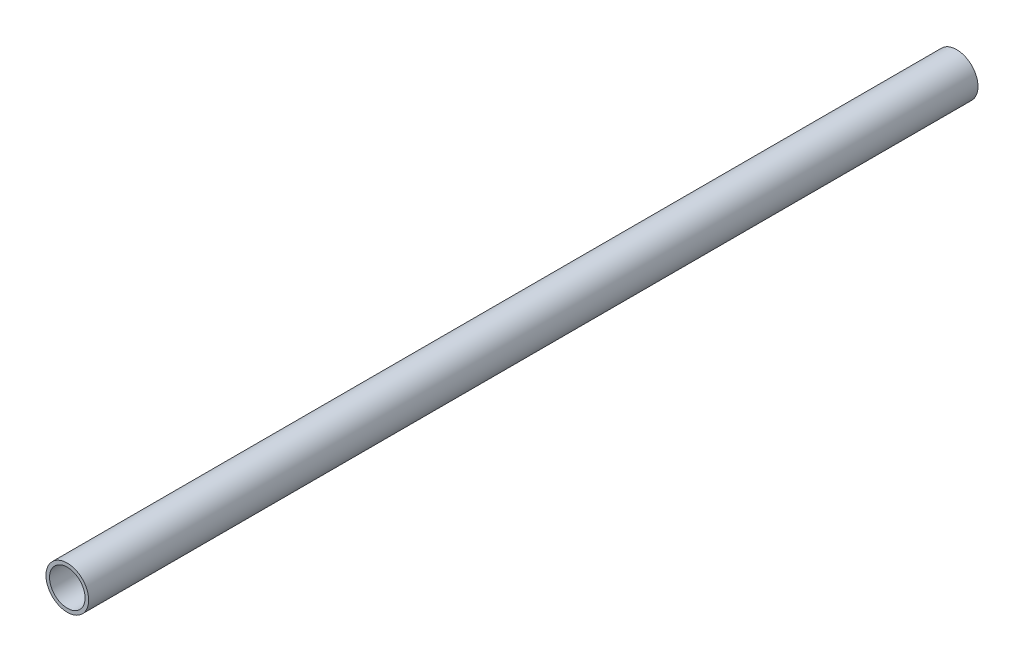
ISO-10303-21;
HEADER;
FILE_DESCRIPTION(('STEP AP214'),'2;1');
FILE_NAME('part.step','',(''),(''),'','','');
FILE_SCHEMA(('AUTOMOTIVE_DESIGN { 1 0 10303 214 1 1 1 1 }'));
ENDSEC;
DATA;
#1=APPLICATION_CONTEXT('core data for automotive mechanical design processes');
#2=APPLICATION_PROTOCOL_DEFINITION('international standard','automotive_design',2000,#1);
#3=PRODUCT_CONTEXT('',#1,'mechanical');
#4=PRODUCT('Part','Part','',(#3));
#5=PRODUCT_RELATED_PRODUCT_CATEGORY('part','',(#4));
#6=PRODUCT_DEFINITION_FORMATION('','',#4);
#7=PRODUCT_DEFINITION_CONTEXT('part definition',#1,'design');
#8=PRODUCT_DEFINITION('design','',#6,#7);
#9=PRODUCT_DEFINITION_SHAPE('','',#8);
#10=(LENGTH_UNIT() NAMED_UNIT(*) SI_UNIT(.MILLI.,.METRE.));
#11=(NAMED_UNIT(*) PLANE_ANGLE_UNIT() SI_UNIT($,.RADIAN.));
#12=(NAMED_UNIT(*) SI_UNIT($,.STERADIAN.) SOLID_ANGLE_UNIT());
#13=UNCERTAINTY_MEASURE_WITH_UNIT(LENGTH_MEASURE(1.E-05),#10,'distance_accuracy_value','');
#14=(GEOMETRIC_REPRESENTATION_CONTEXT(3) GLOBAL_UNCERTAINTY_ASSIGNED_CONTEXT((#13)) GLOBAL_UNIT_ASSIGNED_CONTEXT((#10,
#11,#12)) REPRESENTATION_CONTEXT('',''));
#15=CARTESIAN_POINT('',(0.,0.,0.));
#16=DIRECTION('',(0.,0.,1.));
#17=DIRECTION('',(1.,0.,0.));
#18=AXIS2_PLACEMENT_3D('',#15,#16,#17);
#19=CARTESIAN_POINT('',(0.,0.,250.));
#20=DIRECTION('',(0.,0.,-1.));
#21=DIRECTION('',(-1.,0.,0.));
#22=AXIS2_PLACEMENT_3D('',#19,#20,#21);
#23=CYLINDRICAL_SURFACE('',#22,6.);
#24=CARTESIAN_POINT('',(0.,0.,250.));
#25=DIRECTION('',(0.,0.,1.));
#26=DIRECTION('',(1.,0.,0.));
#27=AXIS2_PLACEMENT_3D('',#24,#25,#26);
#28=CIRCLE('',#27,6.);
#29=CARTESIAN_POINT('',(6.,0.,250.));
#30=VERTEX_POINT('',#29);
#31=EDGE_CURVE('E10',#30,#30,#28,.T.);
#32=ORIENTED_EDGE('',*,*,#31,.F.);
#33=EDGE_LOOP('',(#32));
#34=FACE_BOUND('',#33,.T.);
#35=CARTESIAN_POINT('',(0.,0.,0.));
#36=DIRECTION('',(0.,0.,1.));
#37=DIRECTION('',(1.,0.,0.));
#38=AXIS2_PLACEMENT_3D('',#35,#36,#37);
#39=CIRCLE('',#38,6.);
#40=CARTESIAN_POINT('',(6.,0.,0.));
#41=VERTEX_POINT('',#40);
#42=EDGE_CURVE('E44',#41,#41,#39,.T.);
#43=ORIENTED_EDGE('',*,*,#42,.T.);
#44=EDGE_LOOP('',(#43));
#45=FACE_BOUND('',#44,.T.);
#46=ADVANCED_FACE('F41',(#34,#45),#23,.T.);
#47=CARTESIAN_POINT('',(0.,0.,250.));
#48=DIRECTION('',(0.,0.,1.));
#49=DIRECTION('',(1.,0.,0.));
#50=AXIS2_PLACEMENT_3D('',#47,#48,#49);
#51=PLANE('',#50);
#52=CARTESIAN_POINT('',(0.,0.,250.));
#53=DIRECTION('',(0.,0.,1.));
#54=DIRECTION('',(1.,0.,0.));
#55=AXIS2_PLACEMENT_3D('',#52,#53,#54);
#56=CIRCLE('',#55,5.);
#57=CARTESIAN_POINT('',(5.,0.,250.));
#58=VERTEX_POINT('',#57);
#59=EDGE_CURVE('E53',#58,#58,#56,.T.);
#60=ORIENTED_EDGE('',*,*,#59,.F.);
#61=EDGE_LOOP('',(#60));
#62=FACE_BOUND('',#61,.T.);
#63=ORIENTED_EDGE('',*,*,#31,.T.);
#64=EDGE_LOOP('',(#63));
#65=FACE_BOUND('',#64,.T.);
#66=ADVANCED_FACE('F68',(#62,#65),#51,.T.);
#67=CARTESIAN_POINT('',(0.,0.,0.));
#68=DIRECTION('',(0.,0.,1.));
#69=DIRECTION('',(1.,0.,0.));
#70=AXIS2_PLACEMENT_3D('',#67,#68,#69);
#71=PLANE('',#70);
#72=CARTESIAN_POINT('',(0.,0.,0.));
#73=DIRECTION('',(0.,0.,-1.));
#74=DIRECTION('',(-1.,0.,0.));
#75=AXIS2_PLACEMENT_3D('',#72,#73,#74);
#76=CIRCLE('',#75,5.);
#77=CARTESIAN_POINT('',(-5.,0.,0.));
#78=VERTEX_POINT('',#77);
#79=EDGE_CURVE('E58',#78,#78,#76,.T.);
#80=ORIENTED_EDGE('',*,*,#79,.F.);
#81=EDGE_LOOP('',(#80));
#82=FACE_BOUND('',#81,.T.);
#83=ORIENTED_EDGE('',*,*,#42,.F.);
#84=EDGE_LOOP('',(#83));
#85=FACE_BOUND('',#84,.T.);
#86=ADVANCED_FACE('F65',(#82,#85),#71,.F.);
#87=CARTESIAN_POINT('',(0.,0.,300.));
#88=DIRECTION('',(0.,0.,-1.));
#89=DIRECTION('',(-1.,0.,0.));
#90=AXIS2_PLACEMENT_3D('',#87,#88,#89);
#91=CYLINDRICAL_SURFACE('',#90,5.);
#92=ORIENTED_EDGE('',*,*,#59,.T.);
#93=EDGE_LOOP('',(#92));
#94=FACE_BOUND('',#93,.T.);
#95=ORIENTED_EDGE('',*,*,#79,.T.);
#96=EDGE_LOOP('',(#95));
#97=FACE_BOUND('',#96,.T.);
#98=ADVANCED_FACE('F63',(#94,#97),#91,.F.);
#99=CLOSED_SHELL('',(#46,#66,#86,#98));
#100=MANIFOLD_SOLID_BREP('B2',#99);
#101=ADVANCED_BREP_SHAPE_REPRESENTATION('',(#18,#100),#14);
#102=SHAPE_DEFINITION_REPRESENTATION(#9,#101);
ENDSEC;
END-ISO-10303-21;
